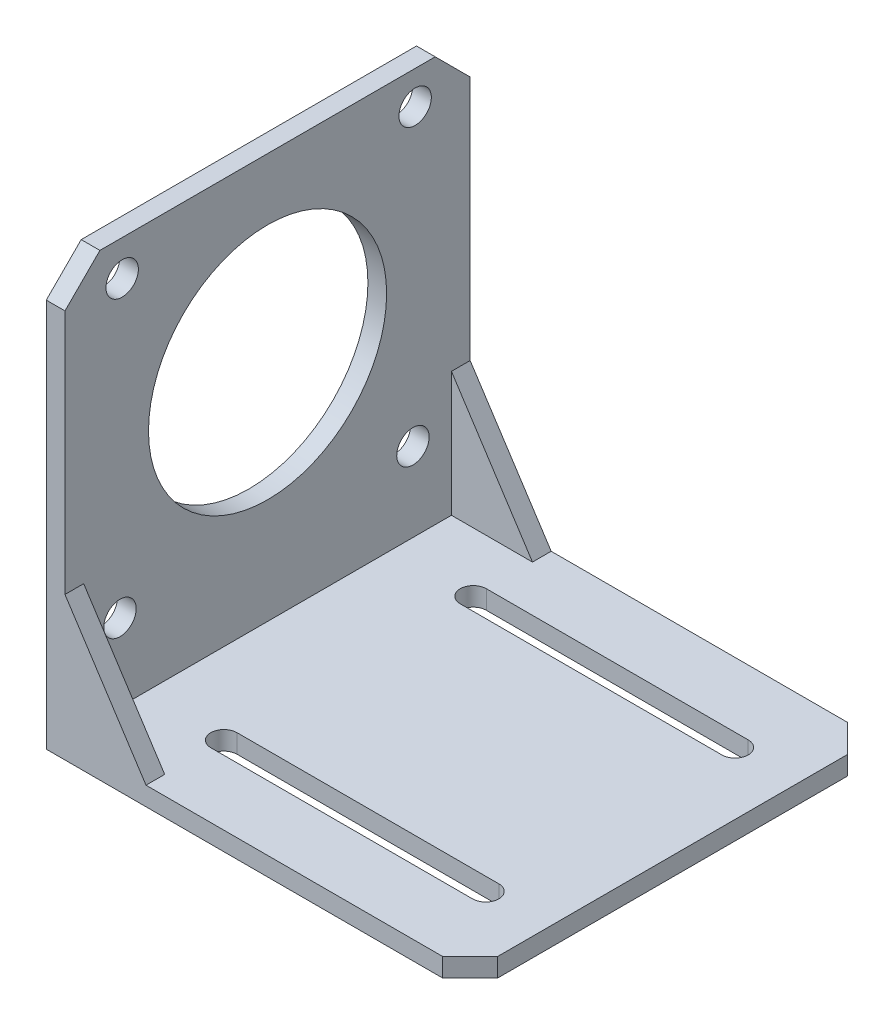
ISO-10303-21;
HEADER;
FILE_DESCRIPTION(('STEP AP214'),'2;1');
FILE_NAME('part.step','',(''),(''),'','','');
FILE_SCHEMA(('AUTOMOTIVE_DESIGN { 1 0 10303 214 1 1 1 1 }'));
ENDSEC;
DATA;
#1=APPLICATION_CONTEXT('core data for automotive mechanical design processes');
#2=APPLICATION_PROTOCOL_DEFINITION('international standard','automotive_design',2000,#1);
#3=PRODUCT_CONTEXT('',#1,'mechanical');
#4=PRODUCT('Part','Part','',(#3));
#5=PRODUCT_RELATED_PRODUCT_CATEGORY('part','',(#4));
#6=PRODUCT_DEFINITION_FORMATION('','',#4);
#7=PRODUCT_DEFINITION_CONTEXT('part definition',#1,'design');
#8=PRODUCT_DEFINITION('design','',#6,#7);
#9=PRODUCT_DEFINITION_SHAPE('','',#8);
#10=(LENGTH_UNIT() NAMED_UNIT(*) SI_UNIT(.MILLI.,.METRE.));
#11=(NAMED_UNIT(*) PLANE_ANGLE_UNIT() SI_UNIT($,.RADIAN.));
#12=(NAMED_UNIT(*) SI_UNIT($,.STERADIAN.) SOLID_ANGLE_UNIT());
#13=UNCERTAINTY_MEASURE_WITH_UNIT(LENGTH_MEASURE(1.E-05),#10,'distance_accuracy_value','');
#14=(GEOMETRIC_REPRESENTATION_CONTEXT(3) GLOBAL_UNCERTAINTY_ASSIGNED_CONTEXT((#13)) GLOBAL_UNIT_ASSIGNED_CONTEXT((#10,
#11,#12)) REPRESENTATION_CONTEXT('',''));
#15=CARTESIAN_POINT('',(0.,0.,0.));
#16=DIRECTION('',(0.,0.,1.));
#17=DIRECTION('',(1.,0.,0.));
#18=AXIS2_PLACEMENT_3D('',#15,#16,#17);
#19=CARTESIAN_POINT('',(0.,68.,0.));
#20=DIRECTION('',(0.,0.,-1.));
#21=DIRECTION('',(-1.,0.,0.));
#22=AXIS2_PLACEMENT_3D('',#19,#20,#21);
#23=PLANE('',#22);
#24=DIRECTION('',(0.,1.,0.));
#25=VECTOR('',#24,1.);
#26=CARTESIAN_POINT('',(63.5734773580445,0.,0.));
#27=LINE('',#26,#25);
#28=CARTESIAN_POINT('',(63.5734773580445,0.,0.));
#29=VERTEX_POINT('',#28);
#30=CARTESIAN_POINT('',(63.5734773580445,2.99999999999999,0.));
#31=VERTEX_POINT('',#30);
#32=EDGE_CURVE('E296',#29,#31,#27,.T.);
#33=ORIENTED_EDGE('',*,*,#32,.T.);
#34=DIRECTION('',(1.,0.,0.));
#35=VECTOR('',#34,1.);
#36=CARTESIAN_POINT('',(0.,3.,0.));
#37=LINE('',#36,#35);
#38=CARTESIAN_POINT('',(16.,3.,0.));
#39=VERTEX_POINT('',#38);
#40=EDGE_CURVE('E270',#39,#31,#37,.T.);
#41=ORIENTED_EDGE('',*,*,#40,.F.);
#42=DIRECTION('',(0.544988350595414,-0.838443616300637,0.));
#43=VECTOR('',#42,1.);
#44=CARTESIAN_POINT('',(12.6186291739895,8.20210896309315,0.));
#45=LINE('',#44,#43);
#46=CARTESIAN_POINT('',(3.00000000000001,23.,0.));
#47=VERTEX_POINT('',#46);
#48=EDGE_CURVE('E266',#47,#39,#45,.T.);
#49=ORIENTED_EDGE('',*,*,#48,.F.);
#50=DIRECTION('',(0.,-1.,0.));
#51=VECTOR('',#50,1.);
#52=CARTESIAN_POINT('',(3.00000000000001,0.,0.));
#53=LINE('',#52,#51);
#54=CARTESIAN_POINT('',(3.,62.3958350511083,0.));
#55=VERTEX_POINT('',#54);
#56=EDGE_CURVE('E275',#55,#47,#53,.T.);
#57=ORIENTED_EDGE('',*,*,#56,.F.);
#58=DIRECTION('',(1.,0.,0.));
#59=VECTOR('',#58,1.);
#60=CARTESIAN_POINT('',(0.,62.3958350511083,0.));
#61=LINE('',#60,#59);
#62=CARTESIAN_POINT('',(0.,62.3958350511083,0.));
#63=VERTEX_POINT('',#62);
#64=EDGE_CURVE('E402',#63,#55,#61,.T.);
#65=ORIENTED_EDGE('',*,*,#64,.F.);
#66=DIRECTION('',(0.,-1.,0.));
#67=VECTOR('',#66,1.);
#68=CARTESIAN_POINT('',(0.,68.,0.));
#69=LINE('',#68,#67);
#70=CARTESIAN_POINT('',(0.,0.,0.));
#71=VERTEX_POINT('',#70);
#72=EDGE_CURVE('E11',#63,#71,#69,.T.);
#73=ORIENTED_EDGE('',*,*,#72,.T.);
#74=DIRECTION('',(1.,0.,0.));
#75=VECTOR('',#74,1.);
#76=CARTESIAN_POINT('',(0.,0.,0.));
#77=LINE('',#76,#75);
#78=EDGE_CURVE('E227',#71,#29,#77,.T.);
#79=ORIENTED_EDGE('',*,*,#78,.T.);
#80=EDGE_LOOP('',(#33,#41,#49,#57,#65,#73,#79));
#81=FACE_BOUND('',#80,.T.);
#82=ADVANCED_FACE('F39',(#81),#23,.F.);
#83=CARTESIAN_POINT('',(68.,68.,0.));
#84=DIRECTION('',(-1.,0.,0.));
#85=DIRECTION('',(0.,0.,1.));
#86=AXIS2_PLACEMENT_3D('',#83,#84,#85);
#87=PLANE('',#86);
#88=DIRECTION('',(0.,1.,0.));
#89=VECTOR('',#88,1.);
#90=CARTESIAN_POINT('',(68.,0.,-4.42652264195545));
#91=LINE('',#90,#89);
#92=CARTESIAN_POINT('',(68.,0.,-4.42652264195545));
#93=VERTEX_POINT('',#92);
#94=CARTESIAN_POINT('',(68.,3.,-4.42652264195545));
#95=VERTEX_POINT('',#94);
#96=EDGE_CURVE('E307',#93,#95,#91,.T.);
#97=ORIENTED_EDGE('',*,*,#96,.F.);
#98=DIRECTION('',(0.,0.,-1.));
#99=VECTOR('',#98,1.);
#100=CARTESIAN_POINT('',(68.,0.,0.));
#101=LINE('',#100,#99);
#102=CARTESIAN_POINT('',(68.,0.,-60.5734773580446));
#103=VERTEX_POINT('',#102);
#104=EDGE_CURVE('E221',#93,#103,#101,.T.);
#105=ORIENTED_EDGE('',*,*,#104,.T.);
#106=DIRECTION('',(0.,1.,0.));
#107=VECTOR('',#106,1.);
#108=CARTESIAN_POINT('',(68.,0.,-60.5734773580446));
#109=LINE('',#108,#107);
#110=CARTESIAN_POINT('',(68.,2.99999999999999,-60.5734773580446));
#111=VERTEX_POINT('',#110);
#112=EDGE_CURVE('E194',#103,#111,#109,.T.);
#113=ORIENTED_EDGE('',*,*,#112,.T.);
#114=DIRECTION('',(0.,0.,1.));
#115=VECTOR('',#114,1.);
#116=CARTESIAN_POINT('',(68.,3.,-65.));
#117=LINE('',#116,#115);
#118=EDGE_CURVE('E284',#111,#95,#117,.T.);
#119=ORIENTED_EDGE('',*,*,#118,.T.);
#120=EDGE_LOOP('',(#97,#105,#113,#119));
#121=FACE_BOUND('',#120,.T.);
#122=ADVANCED_FACE('F493',(#121),#87,.F.);
#123=CARTESIAN_POINT('',(0.,0.,0.));
#124=DIRECTION('',(0.,-1.,0.));
#125=DIRECTION('',(0.,0.,-1.));
#126=AXIS2_PLACEMENT_3D('',#123,#124,#125);
#127=PLANE('',#126);
#128=DIRECTION('',(1.,0.,0.));
#129=VECTOR('',#128,1.);
#130=CARTESIAN_POINT('',(0.,0.,-50.4));
#131=LINE('',#130,#129);
#132=CARTESIAN_POINT('',(16.,0.,-50.4));
#133=VERTEX_POINT('',#132);
#134=CARTESIAN_POINT('',(58.,0.,-50.4));
#135=VERTEX_POINT('',#134);
#136=EDGE_CURVE('E356',#133,#135,#131,.T.);
#137=ORIENTED_EDGE('',*,*,#136,.T.);
#138=CARTESIAN_POINT('',(58.,0.,-52.5));
#139=DIRECTION('',(0.,1.,0.));
#140=DIRECTION('',(-1.,0.,0.));
#141=AXIS2_PLACEMENT_3D('',#138,#139,#140);
#142=CIRCLE('',#141,2.1);
#143=CARTESIAN_POINT('',(58.,0.,-54.6));
#144=VERTEX_POINT('',#143);
#145=EDGE_CURVE('E360',#135,#144,#142,.T.);
#146=ORIENTED_EDGE('',*,*,#145,.T.);
#147=DIRECTION('',(1.,0.,0.));
#148=VECTOR('',#147,1.);
#149=CARTESIAN_POINT('',(0.,0.,-54.6));
#150=LINE('',#149,#148);
#151=CARTESIAN_POINT('',(16.,0.,-54.6));
#152=VERTEX_POINT('',#151);
#153=EDGE_CURVE('E365',#152,#144,#150,.T.);
#154=ORIENTED_EDGE('',*,*,#153,.F.);
#155=CARTESIAN_POINT('',(16.,0.,-52.5));
#156=DIRECTION('',(0.,1.,0.));
#157=DIRECTION('',(-1.,0.,0.));
#158=AXIS2_PLACEMENT_3D('',#155,#156,#157);
#159=CIRCLE('',#158,2.1);
#160=EDGE_CURVE('E368',#152,#133,#159,.T.);
#161=ORIENTED_EDGE('',*,*,#160,.T.);
#162=EDGE_LOOP('',(#137,#146,#154,#161));
#163=FACE_BOUND('',#162,.T.);
#164=ORIENTED_EDGE('',*,*,#104,.F.);
#165=DIRECTION('',(0.707106781186552,0.,-0.707106781186543));
#166=VECTOR('',#165,1.);
#167=CARTESIAN_POINT('',(31.7867386790219,0.,31.7867386790222));
#168=LINE('',#167,#166);
#169=EDGE_CURVE('E299',#29,#93,#168,.T.);
#170=ORIENTED_EDGE('',*,*,#169,.F.);
#171=ORIENTED_EDGE('',*,*,#78,.F.);
#172=DIRECTION('',(0.,0.,1.));
#173=VECTOR('',#172,1.);
#174=CARTESIAN_POINT('',(0.,0.,0.));
#175=LINE('',#174,#173);
#176=CARTESIAN_POINT('',(0.,0.,-65.));
#177=VERTEX_POINT('',#176);
#178=EDGE_CURVE('E218',#177,#71,#175,.T.);
#179=ORIENTED_EDGE('',*,*,#178,.F.);
#180=DIRECTION('',(-1.,0.,0.));
#181=VECTOR('',#180,1.);
#182=CARTESIAN_POINT('',(0.,0.,-65.));
#183=LINE('',#182,#181);
#184=CARTESIAN_POINT('',(63.5734773580445,0.,-65.));
#185=VERTEX_POINT('',#184);
#186=EDGE_CURVE('E206',#185,#177,#183,.T.);
#187=ORIENTED_EDGE('',*,*,#186,.F.);
#188=DIRECTION('',(0.707106781186553,0.,0.707106781186543));
#189=VECTOR('',#188,1.);
#190=CARTESIAN_POINT('',(64.2867386790218,0.,-64.2867386790227));
#191=LINE('',#190,#189);
#192=EDGE_CURVE('E188',#185,#103,#191,.T.);
#193=ORIENTED_EDGE('',*,*,#192,.T.);
#194=EDGE_LOOP('',(#164,#170,#171,#179,#187,#193));
#195=FACE_BOUND('',#194,.T.);
#196=DIRECTION('',(1.,0.,0.));
#197=VECTOR('',#196,1.);
#198=CARTESIAN_POINT('',(0.,0.,-10.4));
#199=LINE('',#198,#197);
#200=CARTESIAN_POINT('',(16.,0.,-10.4));
#201=VERTEX_POINT('',#200);
#202=CARTESIAN_POINT('',(58.,0.,-10.4));
#203=VERTEX_POINT('',#202);
#204=EDGE_CURVE('E326',#201,#203,#199,.T.);
#205=ORIENTED_EDGE('',*,*,#204,.T.);
#206=CARTESIAN_POINT('',(58.,0.,-12.5));
#207=DIRECTION('',(0.,1.,0.));
#208=DIRECTION('',(-1.,0.,0.));
#209=AXIS2_PLACEMENT_3D('',#206,#207,#208);
#210=CIRCLE('',#209,2.1);
#211=CARTESIAN_POINT('',(58.,0.,-14.6));
#212=VERTEX_POINT('',#211);
#213=EDGE_CURVE('E316',#212,#203,#210,.F.);
#214=ORIENTED_EDGE('',*,*,#213,.F.);
#215=DIRECTION('',(1.,0.,0.));
#216=VECTOR('',#215,1.);
#217=CARTESIAN_POINT('',(0.,0.,-14.6));
#218=LINE('',#217,#216);
#219=CARTESIAN_POINT('',(16.,0.,-14.6));
#220=VERTEX_POINT('',#219);
#221=EDGE_CURVE('E319',#220,#212,#218,.T.);
#222=ORIENTED_EDGE('',*,*,#221,.F.);
#223=CARTESIAN_POINT('',(16.,0.,-12.5));
#224=DIRECTION('',(0.,1.,0.));
#225=DIRECTION('',(-1.,0.,0.));
#226=AXIS2_PLACEMENT_3D('',#223,#224,#225);
#227=CIRCLE('',#226,2.1);
#228=EDGE_CURVE('E323',#201,#220,#227,.F.);
#229=ORIENTED_EDGE('',*,*,#228,.F.);
#230=EDGE_LOOP('',(#205,#214,#222,#229));
#231=FACE_BOUND('',#230,.T.);
#232=ADVANCED_FACE('F214',(#163,#195,#231),#127,.T.);
#233=CARTESIAN_POINT('',(0.,3.,-65.));
#234=DIRECTION('',(0.,-1.,0.));
#235=DIRECTION('',(1.,0.,0.));
#236=AXIS2_PLACEMENT_3D('',#233,#234,#235);
#237=PLANE('',#236);
#238=DIRECTION('',(0.707106781186552,0.,-0.707106781186543));
#239=VECTOR('',#238,1.);
#240=CARTESIAN_POINT('',(31.7867386790219,2.99999999999999,31.7867386790222));
#241=LINE('',#240,#239);
#242=EDGE_CURVE('E303',#31,#95,#241,.T.);
#243=ORIENTED_EDGE('',*,*,#242,.T.);
#244=ORIENTED_EDGE('',*,*,#118,.F.);
#245=DIRECTION('',(0.707106781186553,0.,0.707106781186543));
#246=VECTOR('',#245,1.);
#247=CARTESIAN_POINT('',(64.2867386790218,2.99999999999999,-64.2867386790227));
#248=LINE('',#247,#246);
#249=CARTESIAN_POINT('',(63.5734773580445,3.,-65.));
#250=VERTEX_POINT('',#249);
#251=EDGE_CURVE('E200',#250,#111,#248,.T.);
#252=ORIENTED_EDGE('',*,*,#251,.F.);
#253=DIRECTION('',(1.,0.,0.));
#254=VECTOR('',#253,1.);
#255=CARTESIAN_POINT('',(0.,3.,-65.));
#256=LINE('',#255,#254);
#257=CARTESIAN_POINT('',(16.,3.,-65.));
#258=VERTEX_POINT('',#257);
#259=EDGE_CURVE('E210',#258,#250,#256,.T.);
#260=ORIENTED_EDGE('',*,*,#259,.F.);
#261=DIRECTION('',(0.,0.,1.));
#262=VECTOR('',#261,1.);
#263=CARTESIAN_POINT('',(16.,3.,-65.));
#264=LINE('',#263,#262);
#265=CARTESIAN_POINT('',(16.,3.,-62.));
#266=VERTEX_POINT('',#265);
#267=EDGE_CURVE('E260',#258,#266,#264,.T.);
#268=ORIENTED_EDGE('',*,*,#267,.T.);
#269=DIRECTION('',(1.,0.,0.));
#270=VECTOR('',#269,1.);
#271=CARTESIAN_POINT('',(-59.2976725086901,3.,-62.));
#272=LINE('',#271,#270);
#273=CARTESIAN_POINT('',(3.00000000000002,3.,-62.));
#274=VERTEX_POINT('',#273);
#275=EDGE_CURVE('E460',#274,#266,#272,.T.);
#276=ORIENTED_EDGE('',*,*,#275,.F.);
#277=DIRECTION('',(0.,0.,-1.));
#278=VECTOR('',#277,1.);
#279=CARTESIAN_POINT('',(3.00000000000002,2.99999999999999,-3.));
#280=LINE('',#279,#278);
#281=CARTESIAN_POINT('',(3.00000000000002,2.99999999999999,-3.));
#282=VERTEX_POINT('',#281);
#283=EDGE_CURVE('E412',#282,#274,#280,.T.);
#284=ORIENTED_EDGE('',*,*,#283,.F.);
#285=DIRECTION('',(1.,0.,0.));
#286=VECTOR('',#285,1.);
#287=CARTESIAN_POINT('',(-59.2976725086901,2.99999999999999,-3.));
#288=LINE('',#287,#286);
#289=CARTESIAN_POINT('',(16.,2.99999999999999,-3.));
#290=VERTEX_POINT('',#289);
#291=EDGE_CURVE('E465',#282,#290,#288,.T.);
#292=ORIENTED_EDGE('',*,*,#291,.T.);
#293=EDGE_CURVE('E256',#290,#39,#264,.T.);
#294=ORIENTED_EDGE('',*,*,#293,.T.);
#295=ORIENTED_EDGE('',*,*,#40,.T.);
#296=EDGE_LOOP('',(#243,#244,#252,#260,#268,#276,#284,#292,#294,#295));
#297=FACE_BOUND('',#296,.T.);
#298=CARTESIAN_POINT('',(58.,2.99999999999999,-52.5));
#299=DIRECTION('',(0.,1.,0.));
#300=DIRECTION('',(-1.,0.,0.));
#301=AXIS2_PLACEMENT_3D('',#298,#299,#300);
#302=CIRCLE('',#301,2.1);
#303=CARTESIAN_POINT('',(58.,3.,-50.4));
#304=VERTEX_POINT('',#303);
#305=CARTESIAN_POINT('',(58.,2.99999999999999,-54.6));
#306=VERTEX_POINT('',#305);
#307=EDGE_CURVE('E376',#304,#306,#302,.T.);
#308=ORIENTED_EDGE('',*,*,#307,.F.);
#309=DIRECTION('',(1.,0.,0.));
#310=VECTOR('',#309,1.);
#311=CARTESIAN_POINT('',(0.,3.,-50.4));
#312=LINE('',#311,#310);
#313=CARTESIAN_POINT('',(16.,2.99999999999999,-50.4));
#314=VERTEX_POINT('',#313);
#315=EDGE_CURVE('E373',#314,#304,#312,.T.);
#316=ORIENTED_EDGE('',*,*,#315,.F.);
#317=CARTESIAN_POINT('',(16.,2.99999999999999,-52.5));
#318=DIRECTION('',(0.,1.,0.));
#319=DIRECTION('',(-1.,0.,0.));
#320=AXIS2_PLACEMENT_3D('',#317,#318,#319);
#321=CIRCLE('',#320,2.1);
#322=CARTESIAN_POINT('',(16.,2.99999999999999,-54.6));
#323=VERTEX_POINT('',#322);
#324=EDGE_CURVE('E361',#323,#314,#321,.T.);
#325=ORIENTED_EDGE('',*,*,#324,.F.);
#326=DIRECTION('',(1.,0.,0.));
#327=VECTOR('',#326,1.);
#328=CARTESIAN_POINT('',(0.,3.,-54.6));
#329=LINE('',#328,#327);
#330=EDGE_CURVE('E379',#323,#306,#329,.T.);
#331=ORIENTED_EDGE('',*,*,#330,.T.);
#332=EDGE_LOOP('',(#308,#316,#325,#331));
#333=FACE_BOUND('',#332,.T.);
#334=CARTESIAN_POINT('',(58.,2.99999999999999,-12.5));
#335=DIRECTION('',(0.,1.,0.));
#336=DIRECTION('',(-1.,0.,0.));
#337=AXIS2_PLACEMENT_3D('',#334,#335,#336);
#338=CIRCLE('',#337,2.1);
#339=CARTESIAN_POINT('',(58.,3.,-14.6));
#340=VERTEX_POINT('',#339);
#341=CARTESIAN_POINT('',(58.,2.99999999999999,-10.4));
#342=VERTEX_POINT('',#341);
#343=EDGE_CURVE('E331',#340,#342,#338,.F.);
#344=ORIENTED_EDGE('',*,*,#343,.T.);
#345=DIRECTION('',(1.,0.,0.));
#346=VECTOR('',#345,1.);
#347=CARTESIAN_POINT('',(0.,3.,-10.4));
#348=LINE('',#347,#346);
#349=CARTESIAN_POINT('',(16.,2.99999999999999,-10.4));
#350=VERTEX_POINT('',#349);
#351=EDGE_CURVE('E320',#350,#342,#348,.T.);
#352=ORIENTED_EDGE('',*,*,#351,.F.);
#353=CARTESIAN_POINT('',(16.,2.99999999999999,-12.5));
#354=DIRECTION('',(0.,1.,0.));
#355=DIRECTION('',(-1.,0.,0.));
#356=AXIS2_PLACEMENT_3D('',#353,#354,#355);
#357=CIRCLE('',#356,2.1);
#358=CARTESIAN_POINT('',(16.,2.99999999999999,-14.6));
#359=VERTEX_POINT('',#358);
#360=EDGE_CURVE('E339',#350,#359,#357,.F.);
#361=ORIENTED_EDGE('',*,*,#360,.T.);
#362=DIRECTION('',(1.,0.,0.));
#363=VECTOR('',#362,1.);
#364=CARTESIAN_POINT('',(0.,3.,-14.6));
#365=LINE('',#364,#363);
#366=EDGE_CURVE('E335',#359,#340,#365,.T.);
#367=ORIENTED_EDGE('',*,*,#366,.T.);
#368=EDGE_LOOP('',(#344,#352,#361,#367));
#369=FACE_BOUND('',#368,.T.);
#370=ADVANCED_FACE('F486',(#297,#333,#369),#237,.F.);
#371=CARTESIAN_POINT('',(12.6186291739895,8.20210896309315,-65.));
#372=DIRECTION('',(-0.838443616300637,-0.544988350595414,0.));
#373=DIRECTION('',(0.544988350595414,-0.838443616300637,0.));
#374=AXIS2_PLACEMENT_3D('',#371,#372,#373);
#375=PLANE('',#374);
#376=DIRECTION('',(0.,0.,1.));
#377=VECTOR('',#376,1.);
#378=CARTESIAN_POINT('',(3.00000000000001,23.,-65.));
#379=LINE('',#378,#377);
#380=CARTESIAN_POINT('',(3.00000000000001,23.,-65.));
#381=VERTEX_POINT('',#380);
#382=CARTESIAN_POINT('',(3.00000000000001,23.,-62.));
#383=VERTEX_POINT('',#382);
#384=EDGE_CURVE('E253',#381,#383,#379,.T.);
#385=ORIENTED_EDGE('',*,*,#384,.T.);
#386=DIRECTION('',(0.544988350595414,-0.838443616300637,0.));
#387=VECTOR('',#386,1.);
#388=CARTESIAN_POINT('',(12.6186291739895,8.20210896309315,-62.));
#389=LINE('',#388,#387);
#390=EDGE_CURVE('E271',#383,#266,#389,.T.);
#391=ORIENTED_EDGE('',*,*,#390,.T.);
#392=ORIENTED_EDGE('',*,*,#267,.F.);
#393=DIRECTION('',(0.544988350595414,-0.838443616300637,0.));
#394=VECTOR('',#393,1.);
#395=CARTESIAN_POINT('',(12.6186291739895,8.20210896309315,-65.));
#396=LINE('',#395,#394);
#397=EDGE_CURVE('E262',#381,#258,#396,.T.);
#398=ORIENTED_EDGE('',*,*,#397,.F.);
#399=EDGE_LOOP('',(#385,#391,#392,#398));
#400=FACE_BOUND('',#399,.T.);
#401=ADVANCED_FACE('F482',(#400),#375,.F.);
#402=CARTESIAN_POINT('',(0.,68.,0.));
#403=DIRECTION('',(1.,0.,0.));
#404=DIRECTION('',(0.,0.,-1.));
#405=AXIS2_PLACEMENT_3D('',#402,#403,#404);
#406=PLANE('',#405);
#407=CARTESIAN_POINT('',(0.,62.676447309403,-56.176447309403));
#408=DIRECTION('',(1.,0.,0.));
#409=DIRECTION('',(0.,1.,0.));
#410=AXIS2_PLACEMENT_3D('',#407,#408,#409);
#411=CIRCLE('',#410,2.6);
#412=CARTESIAN_POINT('',(0.,65.276447309403,-56.176447309403));
#413=VERTEX_POINT('',#412);
#414=EDGE_CURVE('E426',#413,#413,#411,.T.);
#415=ORIENTED_EDGE('',*,*,#414,.T.);
#416=EDGE_LOOP('',(#415));
#417=FACE_BOUND('',#416,.T.);
#418=CARTESIAN_POINT('',(0.,39.,-32.5));
#419=DIRECTION('',(1.,0.,0.));
#420=DIRECTION('',(0.,1.,0.));
#421=AXIS2_PLACEMENT_3D('',#418,#419,#420);
#422=CIRCLE('',#421,19.1);
#423=CARTESIAN_POINT('',(0.,58.1,-32.5));
#424=VERTEX_POINT('',#423);
#425=EDGE_CURVE('E418',#424,#424,#422,.T.);
#426=ORIENTED_EDGE('',*,*,#425,.T.);
#427=EDGE_LOOP('',(#426));
#428=FACE_BOUND('',#427,.T.);
#429=CARTESIAN_POINT('',(0.,15.6777822065512,-55.8222177934488));
#430=DIRECTION('',(1.,0.,0.));
#431=DIRECTION('',(0.,1.,0.));
#432=AXIS2_PLACEMENT_3D('',#429,#430,#431);
#433=CIRCLE('',#432,2.6);
#434=CARTESIAN_POINT('',(0.,18.2777822065512,-55.8222177934488));
#435=VERTEX_POINT('',#434);
#436=EDGE_CURVE('E417',#435,#435,#433,.T.);
#437=ORIENTED_EDGE('',*,*,#436,.T.);
#438=EDGE_LOOP('',(#437));
#439=FACE_BOUND('',#438,.T.);
#440=CARTESIAN_POINT('',(0.,62.3222177934488,-9.17778220655112));
#441=DIRECTION('',(1.,0.,0.));
#442=DIRECTION('',(0.,1.,0.));
#443=AXIS2_PLACEMENT_3D('',#440,#441,#442);
#444=CIRCLE('',#443,2.6);
#445=CARTESIAN_POINT('',(0.,64.9222177934488,-9.17778220655112));
#446=VERTEX_POINT('',#445);
#447=EDGE_CURVE('E446',#446,#446,#444,.T.);
#448=ORIENTED_EDGE('',*,*,#447,.T.);
#449=EDGE_LOOP('',(#448));
#450=FACE_BOUND('',#449,.T.);
#451=CARTESIAN_POINT('',(0.,15.323552690597,-8.82355269059705));
#452=DIRECTION('',(1.,0.,0.));
#453=DIRECTION('',(0.,1.,0.));
#454=AXIS2_PLACEMENT_3D('',#451,#452,#453);
#455=CIRCLE('',#454,2.6);
#456=CARTESIAN_POINT('',(0.,17.923552690597,-8.82355269059705));
#457=VERTEX_POINT('',#456);
#458=EDGE_CURVE('E389',#457,#457,#455,.T.);
#459=ORIENTED_EDGE('',*,*,#458,.T.);
#460=EDGE_LOOP('',(#459));
#461=FACE_BOUND('',#460,.T.);
#462=ORIENTED_EDGE('',*,*,#72,.F.);
#463=DIRECTION('',(0.,0.707106781186544,-0.707106781186551));
#464=VECTOR('',#463,1.);
#465=CARTESIAN_POINT('',(0.,62.3958350511083,0.));
#466=LINE('',#465,#464);
#467=CARTESIAN_POINT('',(0.,68.,-5.60416494889179));
#468=VERTEX_POINT('',#467);
#469=EDGE_CURVE('E398',#63,#468,#466,.T.);
#470=ORIENTED_EDGE('',*,*,#469,.T.);
#471=DIRECTION('',(0.,0.,1.));
#472=VECTOR('',#471,1.);
#473=CARTESIAN_POINT('',(0.,68.,0.));
#474=LINE('',#473,#472);
#475=CARTESIAN_POINT('',(0.,68.,-59.3958350511082));
#476=VERTEX_POINT('',#475);
#477=EDGE_CURVE('E220',#476,#468,#474,.T.);
#478=ORIENTED_EDGE('',*,*,#477,.F.);
#479=DIRECTION('',(0.,-0.707106781186544,-0.707106781186551));
#480=VECTOR('',#479,1.);
#481=CARTESIAN_POINT('',(0.,68.,-59.3958350511082));
#482=LINE('',#481,#480);
#483=CARTESIAN_POINT('',(0.,62.3958350511083,-65.));
#484=VERTEX_POINT('',#483);
#485=EDGE_CURVE('E235',#476,#484,#482,.T.);
#486=ORIENTED_EDGE('',*,*,#485,.T.);
#487=DIRECTION('',(0.,-1.,0.));
#488=VECTOR('',#487,1.);
#489=CARTESIAN_POINT('',(0.,68.,-65.));
#490=LINE('',#489,#488);
#491=EDGE_CURVE('E48',#484,#177,#490,.T.);
#492=ORIENTED_EDGE('',*,*,#491,.T.);
#493=ORIENTED_EDGE('',*,*,#178,.T.);
#494=EDGE_LOOP('',(#462,#470,#478,#486,#492,#493));
#495=FACE_BOUND('',#494,.T.);
#496=ADVANCED_FACE('F41',(#417,#428,#439,#450,#461,#495),#406,.F.);
#497=CARTESIAN_POINT('',(0.,68.,-65.));
#498=DIRECTION('',(0.,0.,1.));
#499=DIRECTION('',(1.,0.,0.));
#500=AXIS2_PLACEMENT_3D('',#497,#498,#499);
#501=PLANE('',#500);
#502=ORIENTED_EDGE('',*,*,#259,.T.);
#503=DIRECTION('',(0.,1.,0.));
#504=VECTOR('',#503,1.);
#505=CARTESIAN_POINT('',(63.5734773580445,0.,-65.));
#506=LINE('',#505,#504);
#507=EDGE_CURVE('E191',#185,#250,#506,.T.);
#508=ORIENTED_EDGE('',*,*,#507,.F.);
#509=ORIENTED_EDGE('',*,*,#186,.T.);
#510=ORIENTED_EDGE('',*,*,#491,.F.);
#511=DIRECTION('',(1.,0.,0.));
#512=VECTOR('',#511,1.);
#513=CARTESIAN_POINT('',(0.,62.3958350511083,-65.));
#514=LINE('',#513,#512);
#515=CARTESIAN_POINT('',(3.,62.3958350511083,-65.));
#516=VERTEX_POINT('',#515);
#517=EDGE_CURVE('E237',#484,#516,#514,.T.);
#518=ORIENTED_EDGE('',*,*,#517,.T.);
#519=DIRECTION('',(0.,-1.,0.));
#520=VECTOR('',#519,1.);
#521=CARTESIAN_POINT('',(3.00000000000001,0.,-65.));
#522=LINE('',#521,#520);
#523=EDGE_CURVE('E239',#516,#381,#522,.T.);
#524=ORIENTED_EDGE('',*,*,#523,.T.);
#525=ORIENTED_EDGE('',*,*,#397,.T.);
#526=EDGE_LOOP('',(#502,#508,#509,#510,#518,#524,#525));
#527=FACE_BOUND('',#526,.T.);
#528=ADVANCED_FACE('F204',(#527),#501,.F.);
#529=CARTESIAN_POINT('',(0.,68.,0.));
#530=DIRECTION('',(0.,-1.,0.));
#531=DIRECTION('',(0.,0.,-1.));
#532=AXIS2_PLACEMENT_3D('',#529,#530,#531);
#533=PLANE('',#532);
#534=ORIENTED_EDGE('',*,*,#477,.T.);
#535=DIRECTION('',(1.,0.,0.));
#536=VECTOR('',#535,1.);
#537=CARTESIAN_POINT('',(0.,68.,-5.60416494889179));
#538=LINE('',#537,#536);
#539=CARTESIAN_POINT('',(3.,68.,-5.60416494889179));
#540=VERTEX_POINT('',#539);
#541=EDGE_CURVE('E408',#468,#540,#538,.T.);
#542=ORIENTED_EDGE('',*,*,#541,.T.);
#543=DIRECTION('',(0.,0.,1.));
#544=VECTOR('',#543,1.);
#545=CARTESIAN_POINT('',(3.,68.,-65.));
#546=LINE('',#545,#544);
#547=CARTESIAN_POINT('',(3.,68.,-59.3958350511082));
#548=VERTEX_POINT('',#547);
#549=EDGE_CURVE('E281',#548,#540,#546,.T.);
#550=ORIENTED_EDGE('',*,*,#549,.F.);
#551=DIRECTION('',(1.,0.,0.));
#552=VECTOR('',#551,1.);
#553=CARTESIAN_POINT('',(0.,68.,-59.3958350511082));
#554=LINE('',#553,#552);
#555=EDGE_CURVE('E243',#476,#548,#554,.T.);
#556=ORIENTED_EDGE('',*,*,#555,.F.);
#557=EDGE_LOOP('',(#534,#542,#550,#556));
#558=FACE_BOUND('',#557,.T.);
#559=ADVANCED_FACE('F508',(#558),#533,.F.);
#560=ORIENTED_EDGE('',*,*,#293,.F.);
#561=DIRECTION('',(-0.544988350595414,0.838443616300637,0.));
#562=VECTOR('',#561,1.);
#563=CARTESIAN_POINT('',(12.6186291739895,8.20210896309314,-3.));
#564=LINE('',#563,#562);
#565=CARTESIAN_POINT('',(3.00000000000001,23.,-3.));
#566=VERTEX_POINT('',#565);
#567=EDGE_CURVE('E474',#290,#566,#564,.T.);
#568=ORIENTED_EDGE('',*,*,#567,.T.);
#569=EDGE_CURVE('E280',#566,#47,#379,.T.);
#570=ORIENTED_EDGE('',*,*,#569,.T.);
#571=ORIENTED_EDGE('',*,*,#48,.T.);
#572=EDGE_LOOP('',(#560,#568,#570,#571));
#573=FACE_BOUND('',#572,.T.);
#574=ADVANCED_FACE('F500',(#573),#375,.F.);
#575=CARTESIAN_POINT('',(3.00000000000001,0.,-65.));
#576=DIRECTION('',(-1.,0.,0.));
#577=DIRECTION('',(0.,-1.,0.));
#578=AXIS2_PLACEMENT_3D('',#575,#576,#577);
#579=PLANE('',#578);
#580=CARTESIAN_POINT('',(3.,62.676447309403,-56.176447309403));
#581=DIRECTION('',(1.,0.,0.));
#582=DIRECTION('',(0.,1.,0.));
#583=AXIS2_PLACEMENT_3D('',#580,#581,#582);
#584=CIRCLE('',#583,2.6);
#585=CARTESIAN_POINT('',(3.,65.276447309403,-56.176447309403));
#586=VERTEX_POINT('',#585);
#587=EDGE_CURVE('E422',#586,#586,#584,.T.);
#588=ORIENTED_EDGE('',*,*,#587,.F.);
#589=EDGE_LOOP('',(#588));
#590=FACE_BOUND('',#589,.T.);
#591=CARTESIAN_POINT('',(3.00000000000001,39.,-32.5));
#592=DIRECTION('',(1.,0.,0.));
#593=DIRECTION('',(0.,1.,0.));
#594=AXIS2_PLACEMENT_3D('',#591,#592,#593);
#595=CIRCLE('',#594,19.1);
#596=CARTESIAN_POINT('',(3.,58.1,-32.5));
#597=VERTEX_POINT('',#596);
#598=EDGE_CURVE('E413',#597,#597,#595,.T.);
#599=ORIENTED_EDGE('',*,*,#598,.F.);
#600=EDGE_LOOP('',(#599));
#601=FACE_BOUND('',#600,.T.);
#602=CARTESIAN_POINT('',(3.00000000000001,15.6777822065512,-55.8222177934488));
#603=DIRECTION('',(1.,0.,0.));
#604=DIRECTION('',(0.,1.,0.));
#605=AXIS2_PLACEMENT_3D('',#602,#603,#604);
#606=CIRCLE('',#605,2.6);
#607=CARTESIAN_POINT('',(3.00000000000001,18.2777822065512,-55.8222177934488));
#608=VERTEX_POINT('',#607);
#609=EDGE_CURVE('E244',#608,#608,#606,.T.);
#610=ORIENTED_EDGE('',*,*,#609,.F.);
#611=EDGE_LOOP('',(#610));
#612=FACE_BOUND('',#611,.T.);
#613=CARTESIAN_POINT('',(3.,62.3222177934488,-9.17778220655112));
#614=DIRECTION('',(1.,0.,0.));
#615=DIRECTION('',(0.,1.,0.));
#616=AXIS2_PLACEMENT_3D('',#613,#614,#615);
#617=CIRCLE('',#616,2.6);
#618=CARTESIAN_POINT('',(3.,64.9222177934488,-9.17778220655112));
#619=VERTEX_POINT('',#618);
#620=EDGE_CURVE('E429',#619,#619,#617,.T.);
#621=ORIENTED_EDGE('',*,*,#620,.F.);
#622=EDGE_LOOP('',(#621));
#623=FACE_BOUND('',#622,.T.);
#624=CARTESIAN_POINT('',(3.00000000000001,15.323552690597,-8.82355269059705));
#625=DIRECTION('',(1.,0.,0.));
#626=DIRECTION('',(0.,1.,0.));
#627=AXIS2_PLACEMENT_3D('',#624,#625,#626);
#628=CIRCLE('',#627,2.6);
#629=CARTESIAN_POINT('',(3.00000000000001,17.923552690597,-8.82355269059705));
#630=VERTEX_POINT('',#629);
#631=EDGE_CURVE('E450',#630,#630,#628,.T.);
#632=ORIENTED_EDGE('',*,*,#631,.F.);
#633=EDGE_LOOP('',(#632));
#634=FACE_BOUND('',#633,.T.);
#635=ORIENTED_EDGE('',*,*,#549,.T.);
#636=DIRECTION('',(0.,0.707106781186544,-0.707106781186551));
#637=VECTOR('',#636,1.);
#638=CARTESIAN_POINT('',(3.,62.3958350511083,0.));
#639=LINE('',#638,#637);
#640=EDGE_CURVE('E403',#55,#540,#639,.T.);
#641=ORIENTED_EDGE('',*,*,#640,.F.);
#642=ORIENTED_EDGE('',*,*,#56,.T.);
#643=ORIENTED_EDGE('',*,*,#569,.F.);
#644=DIRECTION('',(0.,-1.,0.));
#645=VECTOR('',#644,1.);
#646=CARTESIAN_POINT('',(3.00000000000002,3.00000000000001,-3.));
#647=LINE('',#646,#645);
#648=EDGE_CURVE('E461',#566,#282,#647,.T.);
#649=ORIENTED_EDGE('',*,*,#648,.T.);
#650=ORIENTED_EDGE('',*,*,#283,.T.);
#651=DIRECTION('',(0.,1.,0.));
#652=VECTOR('',#651,1.);
#653=CARTESIAN_POINT('',(3.00000000000002,3.00000000000001,-62.));
#654=LINE('',#653,#652);
#655=EDGE_CURVE('E466',#274,#383,#654,.T.);
#656=ORIENTED_EDGE('',*,*,#655,.T.);
#657=ORIENTED_EDGE('',*,*,#384,.F.);
#658=ORIENTED_EDGE('',*,*,#523,.F.);
#659=DIRECTION('',(0.,-0.707106781186544,-0.707106781186551));
#660=VECTOR('',#659,1.);
#661=CARTESIAN_POINT('',(3.,68.,-59.3958350511082));
#662=LINE('',#661,#660);
#663=EDGE_CURVE('E250',#548,#516,#662,.T.);
#664=ORIENTED_EDGE('',*,*,#663,.F.);
#665=EDGE_LOOP('',(#635,#641,#642,#643,#649,#650,#656,#657,#658,#664));
#666=FACE_BOUND('',#665,.T.);
#667=ADVANCED_FACE('F249',(#590,#601,#612,#623,#634,#666),#579,.F.);
#668=CARTESIAN_POINT('',(-59.2976725086901,3.,-62.));
#669=DIRECTION('',(0.,0.,-1.));
#670=DIRECTION('',(-1.,0.,0.));
#671=AXIS2_PLACEMENT_3D('',#668,#669,#670);
#672=PLANE('',#671);
#673=ORIENTED_EDGE('',*,*,#655,.F.);
#674=ORIENTED_EDGE('',*,*,#275,.T.);
#675=ORIENTED_EDGE('',*,*,#390,.F.);
#676=EDGE_LOOP('',(#673,#674,#675));
#677=FACE_BOUND('',#676,.T.);
#678=ADVANCED_FACE('F545',(#677),#672,.F.);
#679=CARTESIAN_POINT('',(-59.2976725086901,2.99999999999999,-3.));
#680=DIRECTION('',(0.,0.,1.));
#681=DIRECTION('',(0.,-1.,0.));
#682=AXIS2_PLACEMENT_3D('',#679,#680,#681);
#683=PLANE('',#682);
#684=ORIENTED_EDGE('',*,*,#291,.F.);
#685=ORIENTED_EDGE('',*,*,#648,.F.);
#686=ORIENTED_EDGE('',*,*,#567,.F.);
#687=EDGE_LOOP('',(#684,#685,#686));
#688=FACE_BOUND('',#687,.T.);
#689=ADVANCED_FACE('F549',(#688),#683,.F.);
#690=CARTESIAN_POINT('',(0.,15.323552690597,-8.82355269059705));
#691=DIRECTION('',(1.,0.,0.));
#692=DIRECTION('',(0.,1.,0.));
#693=AXIS2_PLACEMENT_3D('',#690,#691,#692);
#694=CYLINDRICAL_SURFACE('',#693,2.6);
#695=ORIENTED_EDGE('',*,*,#458,.F.);
#696=EDGE_LOOP('',(#695));
#697=FACE_BOUND('',#696,.T.);
#698=ORIENTED_EDGE('',*,*,#631,.T.);
#699=EDGE_LOOP('',(#698));
#700=FACE_BOUND('',#699,.T.);
#701=ADVANCED_FACE('F522',(#697,#700),#694,.F.);
#702=CARTESIAN_POINT('',(0.,62.3222177934488,-9.17778220655112));
#703=DIRECTION('',(1.,0.,0.));
#704=DIRECTION('',(0.,1.,0.));
#705=AXIS2_PLACEMENT_3D('',#702,#703,#704);
#706=CYLINDRICAL_SURFACE('',#705,2.6);
#707=ORIENTED_EDGE('',*,*,#447,.F.);
#708=EDGE_LOOP('',(#707));
#709=FACE_BOUND('',#708,.T.);
#710=ORIENTED_EDGE('',*,*,#620,.T.);
#711=EDGE_LOOP('',(#710));
#712=FACE_BOUND('',#711,.T.);
#713=ADVANCED_FACE('F513',(#709,#712),#706,.F.);
#714=CARTESIAN_POINT('',(0.,68.,-59.3958350511082));
#715=DIRECTION('',(0.,-0.707106781186551,0.707106781186544));
#716=DIRECTION('',(0.,-0.707106781186544,-0.707106781186551));
#717=AXIS2_PLACEMENT_3D('',#714,#715,#716);
#718=PLANE('',#717);
#719=ORIENTED_EDGE('',*,*,#663,.T.);
#720=ORIENTED_EDGE('',*,*,#517,.F.);
#721=ORIENTED_EDGE('',*,*,#485,.F.);
#722=ORIENTED_EDGE('',*,*,#555,.T.);
#723=EDGE_LOOP('',(#719,#720,#721,#722));
#724=FACE_BOUND('',#723,.T.);
#725=ADVANCED_FACE('F510',(#724),#718,.F.);
#726=CARTESIAN_POINT('',(0.,15.6777822065512,-55.8222177934488));
#727=DIRECTION('',(1.,0.,0.));
#728=DIRECTION('',(0.,1.,0.));
#729=AXIS2_PLACEMENT_3D('',#726,#727,#728);
#730=CYLINDRICAL_SURFACE('',#729,2.6);
#731=ORIENTED_EDGE('',*,*,#436,.F.);
#732=EDGE_LOOP('',(#731));
#733=FACE_BOUND('',#732,.T.);
#734=ORIENTED_EDGE('',*,*,#609,.T.);
#735=EDGE_LOOP('',(#734));
#736=FACE_BOUND('',#735,.T.);
#737=ADVANCED_FACE('F512',(#733,#736),#730,.F.);
#738=CARTESIAN_POINT('',(0.,39.,-32.5));
#739=DIRECTION('',(1.,0.,0.));
#740=DIRECTION('',(0.,1.,0.));
#741=AXIS2_PLACEMENT_3D('',#738,#739,#740);
#742=CYLINDRICAL_SURFACE('',#741,19.1);
#743=ORIENTED_EDGE('',*,*,#425,.F.);
#744=EDGE_LOOP('',(#743));
#745=FACE_BOUND('',#744,.T.);
#746=ORIENTED_EDGE('',*,*,#598,.T.);
#747=EDGE_LOOP('',(#746));
#748=FACE_BOUND('',#747,.T.);
#749=ADVANCED_FACE('F519',(#745,#748),#742,.F.);
#750=CARTESIAN_POINT('',(0.,62.676447309403,-56.176447309403));
#751=DIRECTION('',(1.,0.,0.));
#752=DIRECTION('',(0.,1.,0.));
#753=AXIS2_PLACEMENT_3D('',#750,#751,#752);
#754=CYLINDRICAL_SURFACE('',#753,2.6);
#755=ORIENTED_EDGE('',*,*,#414,.F.);
#756=EDGE_LOOP('',(#755));
#757=FACE_BOUND('',#756,.T.);
#758=ORIENTED_EDGE('',*,*,#587,.T.);
#759=EDGE_LOOP('',(#758));
#760=FACE_BOUND('',#759,.T.);
#761=ADVANCED_FACE('F584',(#757,#760),#754,.F.);
#762=CARTESIAN_POINT('',(0.,62.3958350511083,0.));
#763=DIRECTION('',(0.,-0.707106781186551,-0.707106781186544));
#764=DIRECTION('',(0.,0.707106781186544,-0.707106781186551));
#765=AXIS2_PLACEMENT_3D('',#762,#763,#764);
#766=PLANE('',#765);
#767=ORIENTED_EDGE('',*,*,#640,.T.);
#768=ORIENTED_EDGE('',*,*,#541,.F.);
#769=ORIENTED_EDGE('',*,*,#469,.F.);
#770=ORIENTED_EDGE('',*,*,#64,.T.);
#771=EDGE_LOOP('',(#767,#768,#769,#770));
#772=FACE_BOUND('',#771,.T.);
#773=ADVANCED_FACE('F506',(#772),#766,.F.);
#774=CARTESIAN_POINT('',(0.,0.,-50.4));
#775=DIRECTION('',(0.,0.,1.));
#776=DIRECTION('',(1.,0.,0.));
#777=AXIS2_PLACEMENT_3D('',#774,#775,#776);
#778=PLANE('',#777);
#779=ORIENTED_EDGE('',*,*,#315,.T.);
#780=DIRECTION('',(0.,1.,0.));
#781=VECTOR('',#780,1.);
#782=CARTESIAN_POINT('',(58.,0.,-50.4));
#783=LINE('',#782,#781);
#784=EDGE_CURVE('E372',#135,#304,#783,.T.);
#785=ORIENTED_EDGE('',*,*,#784,.F.);
#786=ORIENTED_EDGE('',*,*,#136,.F.);
#787=DIRECTION('',(0.,1.,0.));
#788=VECTOR('',#787,1.);
#789=CARTESIAN_POINT('',(16.,0.,-50.4));
#790=LINE('',#789,#788);
#791=EDGE_CURVE('E386',#133,#314,#790,.T.);
#792=ORIENTED_EDGE('',*,*,#791,.T.);
#793=EDGE_LOOP('',(#779,#785,#786,#792));
#794=FACE_BOUND('',#793,.T.);
#795=ADVANCED_FACE('F595',(#794),#778,.F.);
#796=CARTESIAN_POINT('',(16.,0.,-52.5));
#797=DIRECTION('',(0.,1.,0.));
#798=DIRECTION('',(-1.,0.,0.));
#799=AXIS2_PLACEMENT_3D('',#796,#797,#798);
#800=CYLINDRICAL_SURFACE('',#799,2.1);
#801=ORIENTED_EDGE('',*,*,#324,.T.);
#802=ORIENTED_EDGE('',*,*,#791,.F.);
#803=ORIENTED_EDGE('',*,*,#160,.F.);
#804=DIRECTION('',(0.,1.,0.));
#805=VECTOR('',#804,1.);
#806=CARTESIAN_POINT('',(16.,0.,-54.6));
#807=LINE('',#806,#805);
#808=EDGE_CURVE('E390',#152,#323,#807,.T.);
#809=ORIENTED_EDGE('',*,*,#808,.T.);
#810=EDGE_LOOP('',(#801,#802,#803,#809));
#811=FACE_BOUND('',#810,.T.);
#812=ADVANCED_FACE('F598',(#811),#800,.F.);
#813=CARTESIAN_POINT('',(0.,0.,-54.6));
#814=DIRECTION('',(0.,0.,1.));
#815=DIRECTION('',(1.,0.,0.));
#816=AXIS2_PLACEMENT_3D('',#813,#814,#815);
#817=PLANE('',#816);
#818=ORIENTED_EDGE('',*,*,#330,.F.);
#819=ORIENTED_EDGE('',*,*,#808,.F.);
#820=ORIENTED_EDGE('',*,*,#153,.T.);
#821=DIRECTION('',(0.,1.,0.));
#822=VECTOR('',#821,1.);
#823=CARTESIAN_POINT('',(58.,0.,-54.6));
#824=LINE('',#823,#822);
#825=EDGE_CURVE('E63',#144,#306,#824,.T.);
#826=ORIENTED_EDGE('',*,*,#825,.T.);
#827=EDGE_LOOP('',(#818,#819,#820,#826));
#828=FACE_BOUND('',#827,.T.);
#829=ADVANCED_FACE('F603',(#828),#817,.T.);
#830=CARTESIAN_POINT('',(58.,0.,-52.5));
#831=DIRECTION('',(0.,1.,0.));
#832=DIRECTION('',(-1.,0.,0.));
#833=AXIS2_PLACEMENT_3D('',#830,#831,#832);
#834=CYLINDRICAL_SURFACE('',#833,2.1);
#835=ORIENTED_EDGE('',*,*,#307,.T.);
#836=ORIENTED_EDGE('',*,*,#825,.F.);
#837=ORIENTED_EDGE('',*,*,#145,.F.);
#838=ORIENTED_EDGE('',*,*,#784,.T.);
#839=EDGE_LOOP('',(#835,#836,#837,#838));
#840=FACE_BOUND('',#839,.T.);
#841=ADVANCED_FACE('F600',(#840),#834,.F.);
#842=CARTESIAN_POINT('',(64.2867386790218,0.,-64.2867386790227));
#843=DIRECTION('',(-0.707106781186543,0.,0.707106781186553));
#844=DIRECTION('',(0.707106781186553,0.,0.707106781186543));
#845=AXIS2_PLACEMENT_3D('',#842,#843,#844);
#846=PLANE('',#845);
#847=ORIENTED_EDGE('',*,*,#251,.T.);
#848=ORIENTED_EDGE('',*,*,#112,.F.);
#849=ORIENTED_EDGE('',*,*,#192,.F.);
#850=ORIENTED_EDGE('',*,*,#507,.T.);
#851=EDGE_LOOP('',(#847,#848,#849,#850));
#852=FACE_BOUND('',#851,.T.);
#853=ADVANCED_FACE('F190',(#852),#846,.F.);
#854=CARTESIAN_POINT('',(31.7867386790219,0.,31.7867386790222));
#855=DIRECTION('',(0.707106781186543,0.,0.707106781186552));
#856=DIRECTION('',(0.707106781186552,0.,-0.707106781186543));
#857=AXIS2_PLACEMENT_3D('',#854,#855,#856);
#858=PLANE('',#857);
#859=ORIENTED_EDGE('',*,*,#242,.F.);
#860=ORIENTED_EDGE('',*,*,#32,.F.);
#861=ORIENTED_EDGE('',*,*,#169,.T.);
#862=ORIENTED_EDGE('',*,*,#96,.T.);
#863=EDGE_LOOP('',(#859,#860,#861,#862));
#864=FACE_BOUND('',#863,.T.);
#865=ADVANCED_FACE('F494',(#864),#858,.T.);
#866=CARTESIAN_POINT('',(58.,0.,-12.5));
#867=DIRECTION('',(0.,1.,0.));
#868=DIRECTION('',(-1.,0.,0.));
#869=AXIS2_PLACEMENT_3D('',#866,#867,#868);
#870=CYLINDRICAL_SURFACE('',#869,2.1);
#871=ORIENTED_EDGE('',*,*,#343,.F.);
#872=DIRECTION('',(0.,1.,0.));
#873=VECTOR('',#872,1.);
#874=CARTESIAN_POINT('',(58.,0.,-14.6));
#875=LINE('',#874,#873);
#876=EDGE_CURVE('E330',#212,#340,#875,.T.);
#877=ORIENTED_EDGE('',*,*,#876,.F.);
#878=ORIENTED_EDGE('',*,*,#213,.T.);
#879=DIRECTION('',(0.,1.,0.));
#880=VECTOR('',#879,1.);
#881=CARTESIAN_POINT('',(58.,0.,-10.4));
#882=LINE('',#881,#880);
#883=EDGE_CURVE('E310',#203,#342,#882,.T.);
#884=ORIENTED_EDGE('',*,*,#883,.T.);
#885=EDGE_LOOP('',(#871,#877,#878,#884));
#886=FACE_BOUND('',#885,.T.);
#887=ADVANCED_FACE('F610',(#886),#870,.F.);
#888=CARTESIAN_POINT('',(0.,0.,-10.4));
#889=DIRECTION('',(0.,0.,1.));
#890=DIRECTION('',(1.,0.,0.));
#891=AXIS2_PLACEMENT_3D('',#888,#889,#890);
#892=PLANE('',#891);
#893=ORIENTED_EDGE('',*,*,#351,.T.);
#894=ORIENTED_EDGE('',*,*,#883,.F.);
#895=ORIENTED_EDGE('',*,*,#204,.F.);
#896=DIRECTION('',(0.,1.,0.));
#897=VECTOR('',#896,1.);
#898=CARTESIAN_POINT('',(16.,0.,-10.4));
#899=LINE('',#898,#897);
#900=EDGE_CURVE('E348',#201,#350,#899,.T.);
#901=ORIENTED_EDGE('',*,*,#900,.T.);
#902=EDGE_LOOP('',(#893,#894,#895,#901));
#903=FACE_BOUND('',#902,.T.);
#904=ADVANCED_FACE('F613',(#903),#892,.F.);
#905=CARTESIAN_POINT('',(16.,0.,-12.5));
#906=DIRECTION('',(0.,1.,0.));
#907=DIRECTION('',(-1.,0.,0.));
#908=AXIS2_PLACEMENT_3D('',#905,#906,#907);
#909=CYLINDRICAL_SURFACE('',#908,2.1);
#910=ORIENTED_EDGE('',*,*,#360,.F.);
#911=ORIENTED_EDGE('',*,*,#900,.F.);
#912=ORIENTED_EDGE('',*,*,#228,.T.);
#913=DIRECTION('',(0.,1.,0.));
#914=VECTOR('',#913,1.);
#915=CARTESIAN_POINT('',(16.,0.,-14.6));
#916=LINE('',#915,#914);
#917=EDGE_CURVE('E55',#220,#359,#916,.T.);
#918=ORIENTED_EDGE('',*,*,#917,.T.);
#919=EDGE_LOOP('',(#910,#911,#912,#918));
#920=FACE_BOUND('',#919,.T.);
#921=ADVANCED_FACE('F618',(#920),#909,.F.);
#922=CARTESIAN_POINT('',(0.,0.,-14.6));
#923=DIRECTION('',(0.,0.,1.));
#924=DIRECTION('',(1.,0.,0.));
#925=AXIS2_PLACEMENT_3D('',#922,#923,#924);
#926=PLANE('',#925);
#927=ORIENTED_EDGE('',*,*,#366,.F.);
#928=ORIENTED_EDGE('',*,*,#917,.F.);
#929=ORIENTED_EDGE('',*,*,#221,.T.);
#930=ORIENTED_EDGE('',*,*,#876,.T.);
#931=EDGE_LOOP('',(#927,#928,#929,#930));
#932=FACE_BOUND('',#931,.T.);
#933=ADVANCED_FACE('F615',(#932),#926,.T.);
#934=CLOSED_SHELL('',(#82,#122,#232,#370,#401,#496,#528,#559,#574,#667,#678,#689,#701,#713,#725,
#737,#749,#761,#773,#795,#812,#829,#841,#853,#865,#887,#904,#921,#933));
#935=MANIFOLD_SOLID_BREP('B2',#934);
#936=ADVANCED_BREP_SHAPE_REPRESENTATION('',(#18,#935),#14);
#937=SHAPE_DEFINITION_REPRESENTATION(#9,#936);
ENDSEC;
END-ISO-10303-21;
